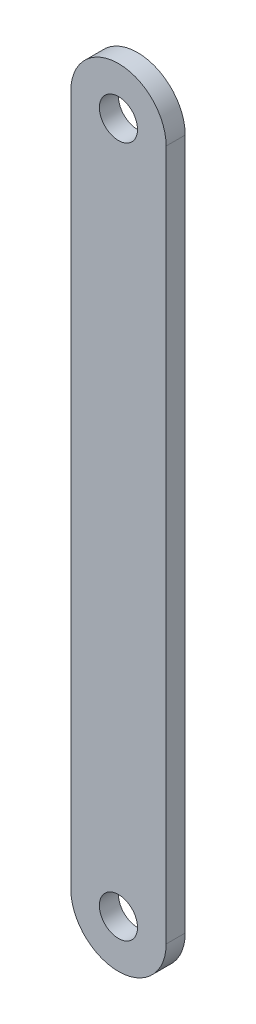
ISO-10303-21;
HEADER;
FILE_DESCRIPTION(('STEP AP214'),'2;1');
FILE_NAME('part.step','',(''),(''),'','','');
FILE_SCHEMA(('AUTOMOTIVE_DESIGN { 1 0 10303 214 1 1 1 1 }'));
ENDSEC;
DATA;
#1=APPLICATION_CONTEXT('core data for automotive mechanical design processes');
#2=APPLICATION_PROTOCOL_DEFINITION('international standard','automotive_design',2000,#1);
#3=PRODUCT_CONTEXT('',#1,'mechanical');
#4=PRODUCT('Part','Part','',(#3));
#5=PRODUCT_RELATED_PRODUCT_CATEGORY('part','',(#4));
#6=PRODUCT_DEFINITION_FORMATION('','',#4);
#7=PRODUCT_DEFINITION_CONTEXT('part definition',#1,'design');
#8=PRODUCT_DEFINITION('design','',#6,#7);
#9=PRODUCT_DEFINITION_SHAPE('','',#8);
#10=(LENGTH_UNIT() NAMED_UNIT(*) SI_UNIT(.MILLI.,.METRE.));
#11=(NAMED_UNIT(*) PLANE_ANGLE_UNIT() SI_UNIT($,.RADIAN.));
#12=(NAMED_UNIT(*) SI_UNIT($,.STERADIAN.) SOLID_ANGLE_UNIT());
#13=UNCERTAINTY_MEASURE_WITH_UNIT(LENGTH_MEASURE(1.E-05),#10,'distance_accuracy_value','');
#14=(GEOMETRIC_REPRESENTATION_CONTEXT(3) GLOBAL_UNCERTAINTY_ASSIGNED_CONTEXT((#13)) GLOBAL_UNIT_ASSIGNED_CONTEXT((#10,
#11,#12)) REPRESENTATION_CONTEXT('',''));
#15=CARTESIAN_POINT('',(0.,0.,0.));
#16=DIRECTION('',(0.,0.,1.));
#17=DIRECTION('',(1.,0.,0.));
#18=AXIS2_PLACEMENT_3D('',#15,#16,#17);
#19=CARTESIAN_POINT('',(5.,-72.5,2.));
#20=DIRECTION('',(-1.,0.,0.));
#21=DIRECTION('',(0.,-1.,0.));
#22=AXIS2_PLACEMENT_3D('',#19,#20,#21);
#23=PLANE('',#22);
#24=DIRECTION('',(0.,0.,1.));
#25=VECTOR('',#24,1.);
#26=CARTESIAN_POINT('',(5.,0.,0.));
#27=LINE('',#26,#25);
#28=CARTESIAN_POINT('',(5.,0.,0.));
#29=VERTEX_POINT('',#28);
#30=CARTESIAN_POINT('',(5.,0.,2.));
#31=VERTEX_POINT('',#30);
#32=EDGE_CURVE('E90',#29,#31,#27,.T.);
#33=ORIENTED_EDGE('',*,*,#32,.T.);
#34=DIRECTION('',(0.,1.,0.));
#35=VECTOR('',#34,1.);
#36=CARTESIAN_POINT('',(5.,-72.5,2.));
#37=LINE('',#36,#35);
#38=CARTESIAN_POINT('',(5.,-72.5,2.));
#39=VERTEX_POINT('',#38);
#40=EDGE_CURVE('E78',#39,#31,#37,.T.);
#41=ORIENTED_EDGE('',*,*,#40,.F.);
#42=DIRECTION('',(0.,0.,-1.));
#43=VECTOR('',#42,1.);
#44=CARTESIAN_POINT('',(5.,-72.5,2.));
#45=LINE('',#44,#43);
#46=CARTESIAN_POINT('',(5.,-72.5,0.));
#47=VERTEX_POINT('',#46);
#48=EDGE_CURVE('E11',#39,#47,#45,.T.);
#49=ORIENTED_EDGE('',*,*,#48,.T.);
#50=DIRECTION('',(0.,1.,0.));
#51=VECTOR('',#50,1.);
#52=CARTESIAN_POINT('',(5.,-72.5,0.));
#53=LINE('',#52,#51);
#54=EDGE_CURVE('E61',#47,#29,#53,.T.);
#55=ORIENTED_EDGE('',*,*,#54,.T.);
#56=EDGE_LOOP('',(#33,#41,#49,#55));
#57=FACE_BOUND('',#56,.T.);
#58=ADVANCED_FACE('F16',(#57),#23,.F.);
#59=CARTESIAN_POINT('',(0.,-72.5,2.));
#60=DIRECTION('',(0.,0.,1.));
#61=DIRECTION('',(1.,0.,0.));
#62=AXIS2_PLACEMENT_3D('',#59,#60,#61);
#63=PLANE('',#62);
#64=CARTESIAN_POINT('',(0.,0.,2.));
#65=DIRECTION('',(0.,0.,-1.));
#66=DIRECTION('',(-1.,0.,0.));
#67=AXIS2_PLACEMENT_3D('',#64,#65,#66);
#68=CIRCLE('',#67,5.);
#69=CARTESIAN_POINT('',(-5.,0.,2.));
#70=VERTEX_POINT('',#69);
#71=EDGE_CURVE('E94',#70,#31,#68,.T.);
#72=ORIENTED_EDGE('',*,*,#71,.F.);
#73=DIRECTION('',(0.,-1.,0.));
#74=VECTOR('',#73,1.);
#75=CARTESIAN_POINT('',(-5.,-72.5,2.));
#76=LINE('',#75,#74);
#77=CARTESIAN_POINT('',(-5.,-72.5,2.));
#78=VERTEX_POINT('',#77);
#79=EDGE_CURVE('E40',#70,#78,#76,.T.);
#80=ORIENTED_EDGE('',*,*,#79,.T.);
#81=CARTESIAN_POINT('',(0.,-72.5,2.));
#82=DIRECTION('',(0.,0.,1.));
#83=DIRECTION('',(1.,0.,0.));
#84=AXIS2_PLACEMENT_3D('',#81,#82,#83);
#85=CIRCLE('',#84,5.);
#86=EDGE_CURVE('E60',#78,#39,#85,.T.);
#87=ORIENTED_EDGE('',*,*,#86,.T.);
#88=ORIENTED_EDGE('',*,*,#40,.T.);
#89=EDGE_LOOP('',(#72,#80,#87,#88));
#90=FACE_BOUND('',#89,.T.);
#91=CARTESIAN_POINT('',(0.,-72.5,2.));
#92=DIRECTION('',(0.,0.,1.));
#93=DIRECTION('',(1.,0.,0.));
#94=AXIS2_PLACEMENT_3D('',#91,#92,#93);
#95=CIRCLE('',#94,2.);
#96=CARTESIAN_POINT('',(2.,-72.5,2.));
#97=VERTEX_POINT('',#96);
#98=EDGE_CURVE('E70',#97,#97,#95,.T.);
#99=ORIENTED_EDGE('',*,*,#98,.F.);
#100=EDGE_LOOP('',(#99));
#101=FACE_BOUND('',#100,.T.);
#102=CARTESIAN_POINT('',(0.,0.,2.));
#103=DIRECTION('',(0.,0.,1.));
#104=DIRECTION('',(1.,0.,0.));
#105=AXIS2_PLACEMENT_3D('',#102,#103,#104);
#106=CIRCLE('',#105,2.);
#107=CARTESIAN_POINT('',(1.99999999999998,0.,2.));
#108=VERTEX_POINT('',#107);
#109=EDGE_CURVE('E83',#108,#108,#106,.T.);
#110=ORIENTED_EDGE('',*,*,#109,.F.);
#111=EDGE_LOOP('',(#110));
#112=FACE_BOUND('',#111,.T.);
#113=ADVANCED_FACE('F101',(#90,#101,#112),#63,.T.);
#114=CARTESIAN_POINT('',(0.,-72.5,0.));
#115=DIRECTION('',(0.,0.,1.));
#116=DIRECTION('',(1.,0.,0.));
#117=AXIS2_PLACEMENT_3D('',#114,#115,#116);
#118=PLANE('',#117);
#119=CARTESIAN_POINT('',(0.,-72.5,0.));
#120=DIRECTION('',(0.,0.,1.));
#121=DIRECTION('',(1.,0.,0.));
#122=AXIS2_PLACEMENT_3D('',#119,#120,#121);
#123=CIRCLE('',#122,2.);
#124=CARTESIAN_POINT('',(2.,-72.5,0.));
#125=VERTEX_POINT('',#124);
#126=EDGE_CURVE('E74',#125,#125,#123,.T.);
#127=ORIENTED_EDGE('',*,*,#126,.T.);
#128=EDGE_LOOP('',(#127));
#129=FACE_BOUND('',#128,.T.);
#130=DIRECTION('',(0.,-1.,0.));
#131=VECTOR('',#130,1.);
#132=CARTESIAN_POINT('',(-5.,-72.5,0.));
#133=LINE('',#132,#131);
#134=CARTESIAN_POINT('',(-5.,0.,0.));
#135=VERTEX_POINT('',#134);
#136=CARTESIAN_POINT('',(-5.,-72.5,0.));
#137=VERTEX_POINT('',#136);
#138=EDGE_CURVE('E53',#135,#137,#133,.T.);
#139=ORIENTED_EDGE('',*,*,#138,.F.);
#140=CARTESIAN_POINT('',(0.,0.,0.));
#141=DIRECTION('',(0.,0.,-1.));
#142=DIRECTION('',(-1.,0.,0.));
#143=AXIS2_PLACEMENT_3D('',#140,#141,#142);
#144=CIRCLE('',#143,5.);
#145=EDGE_CURVE('E31',#135,#29,#144,.T.);
#146=ORIENTED_EDGE('',*,*,#145,.T.);
#147=ORIENTED_EDGE('',*,*,#54,.F.);
#148=CARTESIAN_POINT('',(0.,-72.5,0.));
#149=DIRECTION('',(0.,0.,1.));
#150=DIRECTION('',(1.,0.,0.));
#151=AXIS2_PLACEMENT_3D('',#148,#149,#150);
#152=CIRCLE('',#151,5.);
#153=EDGE_CURVE('E66',#137,#47,#152,.T.);
#154=ORIENTED_EDGE('',*,*,#153,.F.);
#155=EDGE_LOOP('',(#139,#146,#147,#154));
#156=FACE_BOUND('',#155,.T.);
#157=CARTESIAN_POINT('',(0.,0.,0.));
#158=DIRECTION('',(0.,0.,1.));
#159=DIRECTION('',(1.,0.,0.));
#160=AXIS2_PLACEMENT_3D('',#157,#158,#159);
#161=CIRCLE('',#160,2.);
#162=CARTESIAN_POINT('',(1.99999999999998,0.,0.));
#163=VERTEX_POINT('',#162);
#164=EDGE_CURVE('E85',#163,#163,#161,.T.);
#165=ORIENTED_EDGE('',*,*,#164,.T.);
#166=EDGE_LOOP('',(#165));
#167=FACE_BOUND('',#166,.T.);
#168=ADVANCED_FACE('F67',(#129,#156,#167),#118,.F.);
#169=CARTESIAN_POINT('',(0.,-72.5,2.));
#170=DIRECTION('',(0.,0.,-1.));
#171=DIRECTION('',(-1.,0.,0.));
#172=AXIS2_PLACEMENT_3D('',#169,#170,#171);
#173=CYLINDRICAL_SURFACE('',#172,5.);
#174=ORIENTED_EDGE('',*,*,#153,.T.);
#175=ORIENTED_EDGE('',*,*,#48,.F.);
#176=ORIENTED_EDGE('',*,*,#86,.F.);
#177=DIRECTION('',(0.,0.,-1.));
#178=VECTOR('',#177,1.);
#179=CARTESIAN_POINT('',(-5.,-72.5,2.));
#180=LINE('',#179,#178);
#181=EDGE_CURVE('E24',#78,#137,#180,.T.);
#182=ORIENTED_EDGE('',*,*,#181,.T.);
#183=EDGE_LOOP('',(#174,#175,#176,#182));
#184=FACE_BOUND('',#183,.T.);
#185=ADVANCED_FACE('F18',(#184),#173,.T.);
#186=CARTESIAN_POINT('',(-5.,-72.5,2.));
#187=DIRECTION('',(1.,0.,0.));
#188=DIRECTION('',(0.,1.,0.));
#189=AXIS2_PLACEMENT_3D('',#186,#187,#188);
#190=PLANE('',#189);
#191=ORIENTED_EDGE('',*,*,#79,.F.);
#192=DIRECTION('',(0.,0.,1.));
#193=VECTOR('',#192,1.);
#194=CARTESIAN_POINT('',(-5.,0.,0.));
#195=LINE('',#194,#193);
#196=EDGE_CURVE('E57',#135,#70,#195,.T.);
#197=ORIENTED_EDGE('',*,*,#196,.F.);
#198=ORIENTED_EDGE('',*,*,#138,.T.);
#199=ORIENTED_EDGE('',*,*,#181,.F.);
#200=EDGE_LOOP('',(#191,#197,#198,#199));
#201=FACE_BOUND('',#200,.T.);
#202=ADVANCED_FACE('F55',(#201),#190,.F.);
#203=CARTESIAN_POINT('',(0.,-72.5,2.));
#204=DIRECTION('',(0.,0.,-1.));
#205=DIRECTION('',(-1.,0.,0.));
#206=AXIS2_PLACEMENT_3D('',#203,#204,#205);
#207=CYLINDRICAL_SURFACE('',#206,2.);
#208=ORIENTED_EDGE('',*,*,#98,.T.);
#209=EDGE_LOOP('',(#208));
#210=FACE_BOUND('',#209,.T.);
#211=ORIENTED_EDGE('',*,*,#126,.F.);
#212=EDGE_LOOP('',(#211));
#213=FACE_BOUND('',#212,.T.);
#214=ADVANCED_FACE('F113',(#210,#213),#207,.F.);
#215=CARTESIAN_POINT('',(0.,0.,2.));
#216=DIRECTION('',(0.,0.,-1.));
#217=DIRECTION('',(-1.,0.,0.));
#218=AXIS2_PLACEMENT_3D('',#215,#216,#217);
#219=CYLINDRICAL_SURFACE('',#218,2.);
#220=ORIENTED_EDGE('',*,*,#109,.T.);
#221=EDGE_LOOP('',(#220));
#222=FACE_BOUND('',#221,.T.);
#223=ORIENTED_EDGE('',*,*,#164,.F.);
#224=EDGE_LOOP('',(#223));
#225=FACE_BOUND('',#224,.T.);
#226=ADVANCED_FACE('F109',(#222,#225),#219,.F.);
#227=CARTESIAN_POINT('',(0.,0.,0.));
#228=DIRECTION('',(0.,0.,1.));
#229=DIRECTION('',(1.,0.,0.));
#230=AXIS2_PLACEMENT_3D('',#227,#228,#229);
#231=CYLINDRICAL_SURFACE('',#230,5.);
#232=ORIENTED_EDGE('',*,*,#71,.T.);
#233=ORIENTED_EDGE('',*,*,#32,.F.);
#234=ORIENTED_EDGE('',*,*,#145,.F.);
#235=ORIENTED_EDGE('',*,*,#196,.T.);
#236=EDGE_LOOP('',(#232,#233,#234,#235));
#237=FACE_BOUND('',#236,.T.);
#238=ADVANCED_FACE('F112',(#237),#231,.T.);
#239=CLOSED_SHELL('',(#58,#113,#168,#185,#202,#214,#226,#238));
#240=MANIFOLD_SOLID_BREP('B1',#239);
#241=ADVANCED_BREP_SHAPE_REPRESENTATION('',(#18,#240),#14);
#242=SHAPE_DEFINITION_REPRESENTATION(#9,#241);
ENDSEC;
END-ISO-10303-21;
